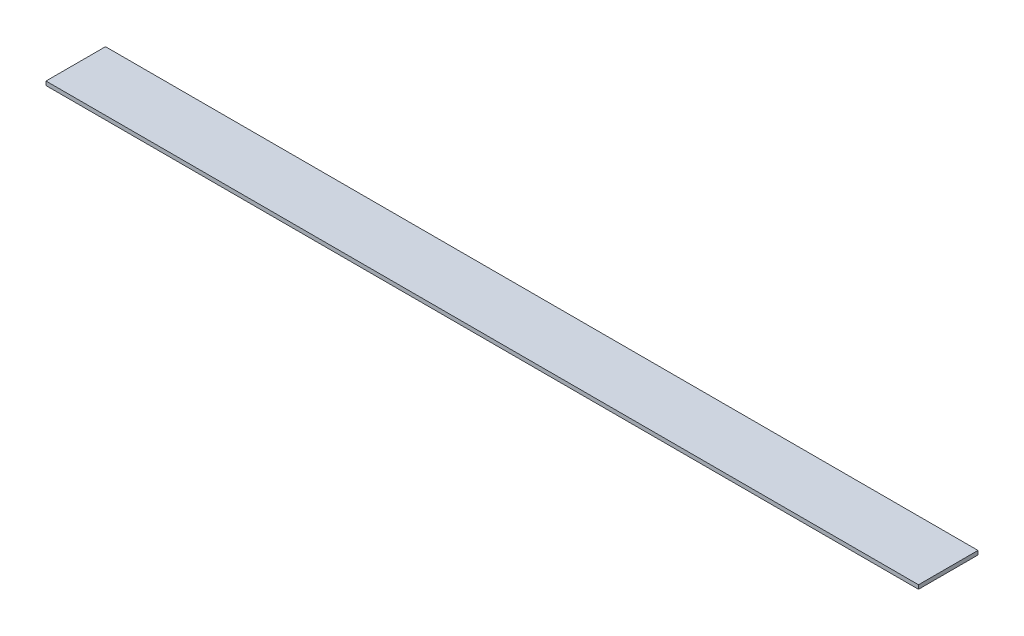
ISO-10303-21;
HEADER;
FILE_DESCRIPTION(('STEP AP214'),'2;1');
FILE_NAME('part.step','',(''),(''),'','','');
FILE_SCHEMA(('AUTOMOTIVE_DESIGN { 1 0 10303 214 1 1 1 1 }'));
ENDSEC;
DATA;
#1=APPLICATION_CONTEXT('core data for automotive mechanical design processes');
#2=APPLICATION_PROTOCOL_DEFINITION('international standard','automotive_design',2000,#1);
#3=PRODUCT_CONTEXT('',#1,'mechanical');
#4=PRODUCT('Part','Part','',(#3));
#5=PRODUCT_RELATED_PRODUCT_CATEGORY('part','',(#4));
#6=PRODUCT_DEFINITION_FORMATION('','',#4);
#7=PRODUCT_DEFINITION_CONTEXT('part definition',#1,'design');
#8=PRODUCT_DEFINITION('design','',#6,#7);
#9=PRODUCT_DEFINITION_SHAPE('','',#8);
#10=(LENGTH_UNIT() NAMED_UNIT(*) SI_UNIT(.MILLI.,.METRE.));
#11=(NAMED_UNIT(*) PLANE_ANGLE_UNIT() SI_UNIT($,.RADIAN.));
#12=(NAMED_UNIT(*) SI_UNIT($,.STERADIAN.) SOLID_ANGLE_UNIT());
#13=UNCERTAINTY_MEASURE_WITH_UNIT(LENGTH_MEASURE(1.E-05),#10,'distance_accuracy_value','');
#14=(GEOMETRIC_REPRESENTATION_CONTEXT(3) GLOBAL_UNCERTAINTY_ASSIGNED_CONTEXT((#13)) GLOBAL_UNIT_ASSIGNED_CONTEXT((#10,
#11,#12)) REPRESENTATION_CONTEXT('',''));
#15=CARTESIAN_POINT('',(0.,0.,0.));
#16=DIRECTION('',(0.,0.,1.));
#17=DIRECTION('',(1.,0.,0.));
#18=AXIS2_PLACEMENT_3D('',#15,#16,#17);
#19=CARTESIAN_POINT('',(0.,0.,5.));
#20=DIRECTION('',(0.,0.,-1.));
#21=DIRECTION('',(-1.,0.,0.));
#22=AXIS2_PLACEMENT_3D('',#19,#20,#21);
#23=PLANE('',#22);
#24=DIRECTION('',(-1.,0.,0.));
#25=VECTOR('',#24,1.);
#26=CARTESIAN_POINT('',(-502.733741957931,-50.,5.));
#27=LINE('',#26,#25);
#28=CARTESIAN_POINT('',(597.266258042068,-50.,5.));
#29=VERTEX_POINT('',#28);
#30=CARTESIAN_POINT('',(-502.733741957931,-50.,5.));
#31=VERTEX_POINT('',#30);
#32=EDGE_CURVE('E79',#29,#31,#27,.T.);
#33=ORIENTED_EDGE('',*,*,#32,.T.);
#34=DIRECTION('',(0.,1.,0.));
#35=VECTOR('',#34,1.);
#36=CARTESIAN_POINT('',(-502.733741957931,0.,5.));
#37=LINE('',#36,#35);
#38=CARTESIAN_POINT('',(-502.733741957931,-45.,5.));
#39=VERTEX_POINT('',#38);
#40=EDGE_CURVE('E36',#31,#39,#37,.T.);
#41=ORIENTED_EDGE('',*,*,#40,.T.);
#42=DIRECTION('',(-1.,0.,0.));
#43=VECTOR('',#42,1.);
#44=CARTESIAN_POINT('',(-502.733741957931,-45.,5.));
#45=LINE('',#44,#43);
#46=CARTESIAN_POINT('',(597.266258042068,-45.,5.));
#47=VERTEX_POINT('',#46);
#48=EDGE_CURVE('E87',#47,#39,#45,.T.);
#49=ORIENTED_EDGE('',*,*,#48,.F.);
#50=DIRECTION('',(0.,1.,0.));
#51=VECTOR('',#50,1.);
#52=CARTESIAN_POINT('',(597.266258042068,0.,5.));
#53=LINE('',#52,#51);
#54=EDGE_CURVE('E86',#29,#47,#53,.T.);
#55=ORIENTED_EDGE('',*,*,#54,.F.);
#56=EDGE_LOOP('',(#33,#41,#49,#55));
#57=FACE_BOUND('',#56,.T.);
#58=ADVANCED_FACE('F32',(#57),#23,.T.);
#59=CARTESIAN_POINT('',(-502.733741957931,-50.,80.));
#60=DIRECTION('',(0.,1.,0.));
#61=DIRECTION('',(0.,0.,1.));
#62=AXIS2_PLACEMENT_3D('',#59,#60,#61);
#63=PLANE('',#62);
#64=ORIENTED_EDGE('',*,*,#32,.F.);
#65=DIRECTION('',(0.,0.,-1.));
#66=VECTOR('',#65,1.);
#67=CARTESIAN_POINT('',(597.266258042068,-50.,80.));
#68=LINE('',#67,#66);
#69=CARTESIAN_POINT('',(597.266258042068,-50.,80.));
#70=VERTEX_POINT('',#69);
#71=EDGE_CURVE('E11',#70,#29,#68,.T.);
#72=ORIENTED_EDGE('',*,*,#71,.F.);
#73=DIRECTION('',(1.,0.,0.));
#74=VECTOR('',#73,1.);
#75=CARTESIAN_POINT('',(-502.733741957931,-50.,80.));
#76=LINE('',#75,#74);
#77=CARTESIAN_POINT('',(-502.733741957931,-50.,80.));
#78=VERTEX_POINT('',#77);
#79=EDGE_CURVE('E49',#78,#70,#76,.T.);
#80=ORIENTED_EDGE('',*,*,#79,.F.);
#81=DIRECTION('',(0.,0.,-1.));
#82=VECTOR('',#81,1.);
#83=CARTESIAN_POINT('',(-502.733741957931,-50.,80.));
#84=LINE('',#83,#82);
#85=EDGE_CURVE('E75',#78,#31,#84,.T.);
#86=ORIENTED_EDGE('',*,*,#85,.T.);
#87=EDGE_LOOP('',(#64,#72,#80,#86));
#88=FACE_BOUND('',#87,.T.);
#89=ADVANCED_FACE('F77',(#88),#63,.F.);
#90=CARTESIAN_POINT('',(-502.733741957931,0.,80.));
#91=DIRECTION('',(0.,0.,1.));
#92=DIRECTION('',(1.,0.,0.));
#93=AXIS2_PLACEMENT_3D('',#90,#91,#92);
#94=PLANE('',#93);
#95=DIRECTION('',(0.,1.,0.));
#96=VECTOR('',#95,1.);
#97=CARTESIAN_POINT('',(-502.733741957931,0.,80.));
#98=LINE('',#97,#96);
#99=CARTESIAN_POINT('',(-502.733741957931,-45.,80.));
#100=VERTEX_POINT('',#99);
#101=EDGE_CURVE('E54',#78,#100,#98,.T.);
#102=ORIENTED_EDGE('',*,*,#101,.F.);
#103=ORIENTED_EDGE('',*,*,#79,.T.);
#104=DIRECTION('',(0.,1.,0.));
#105=VECTOR('',#104,1.);
#106=CARTESIAN_POINT('',(597.266258042068,0.,80.));
#107=LINE('',#106,#105);
#108=CARTESIAN_POINT('',(597.266258042068,-45.,80.));
#109=VERTEX_POINT('',#108);
#110=EDGE_CURVE('E41',#70,#109,#107,.T.);
#111=ORIENTED_EDGE('',*,*,#110,.T.);
#112=DIRECTION('',(1.,0.,0.));
#113=VECTOR('',#112,1.);
#114=CARTESIAN_POINT('',(-502.733741957931,-45.,80.));
#115=LINE('',#114,#113);
#116=EDGE_CURVE('E100',#100,#109,#115,.T.);
#117=ORIENTED_EDGE('',*,*,#116,.F.);
#118=EDGE_LOOP('',(#102,#103,#111,#117));
#119=FACE_BOUND('',#118,.T.);
#120=ADVANCED_FACE('F104',(#119),#94,.T.);
#121=CARTESIAN_POINT('',(-502.733741957931,0.,0.));
#122=DIRECTION('',(1.,0.,0.));
#123=DIRECTION('',(0.,0.,-1.));
#124=AXIS2_PLACEMENT_3D('',#121,#122,#123);
#125=PLANE('',#124);
#126=ORIENTED_EDGE('',*,*,#40,.F.);
#127=ORIENTED_EDGE('',*,*,#85,.F.);
#128=ORIENTED_EDGE('',*,*,#101,.T.);
#129=DIRECTION('',(0.,0.,1.));
#130=VECTOR('',#129,1.);
#131=CARTESIAN_POINT('',(-502.733741957931,-45.,80.));
#132=LINE('',#131,#130);
#133=EDGE_CURVE('E89',#100,#39,#132,.F.);
#134=ORIENTED_EDGE('',*,*,#133,.T.);
#135=EDGE_LOOP('',(#126,#127,#128,#134));
#136=FACE_BOUND('',#135,.T.);
#137=ADVANCED_FACE('F88',(#136),#125,.F.);
#138=CARTESIAN_POINT('',(597.266258042068,0.,0.));
#139=DIRECTION('',(1.,0.,0.));
#140=DIRECTION('',(0.,0.,-1.));
#141=AXIS2_PLACEMENT_3D('',#138,#139,#140);
#142=PLANE('',#141);
#143=ORIENTED_EDGE('',*,*,#71,.T.);
#144=ORIENTED_EDGE('',*,*,#54,.T.);
#145=DIRECTION('',(0.,0.,-1.));
#146=VECTOR('',#145,1.);
#147=CARTESIAN_POINT('',(597.266258042068,-45.,80.));
#148=LINE('',#147,#146);
#149=EDGE_CURVE('E95',#109,#47,#148,.T.);
#150=ORIENTED_EDGE('',*,*,#149,.F.);
#151=ORIENTED_EDGE('',*,*,#110,.F.);
#152=EDGE_LOOP('',(#143,#144,#150,#151));
#153=FACE_BOUND('',#152,.T.);
#154=ADVANCED_FACE('F106',(#153),#142,.T.);
#155=CARTESIAN_POINT('',(-502.733741957931,-45.,80.));
#156=DIRECTION('',(0.,1.,0.));
#157=DIRECTION('',(0.,0.,1.));
#158=AXIS2_PLACEMENT_3D('',#155,#156,#157);
#159=PLANE('',#158);
#160=ORIENTED_EDGE('',*,*,#149,.T.);
#161=ORIENTED_EDGE('',*,*,#48,.T.);
#162=ORIENTED_EDGE('',*,*,#133,.F.);
#163=ORIENTED_EDGE('',*,*,#116,.T.);
#164=EDGE_LOOP('',(#160,#161,#162,#163));
#165=FACE_BOUND('',#164,.T.);
#166=ADVANCED_FACE('F34',(#165),#159,.T.);
#167=CLOSED_SHELL('',(#58,#89,#120,#137,#154,#166));
#168=MANIFOLD_SOLID_BREP('B2',#167);
#169=ADVANCED_BREP_SHAPE_REPRESENTATION('',(#18,#168),#14);
#170=SHAPE_DEFINITION_REPRESENTATION(#9,#169);
ENDSEC;
END-ISO-10303-21;
